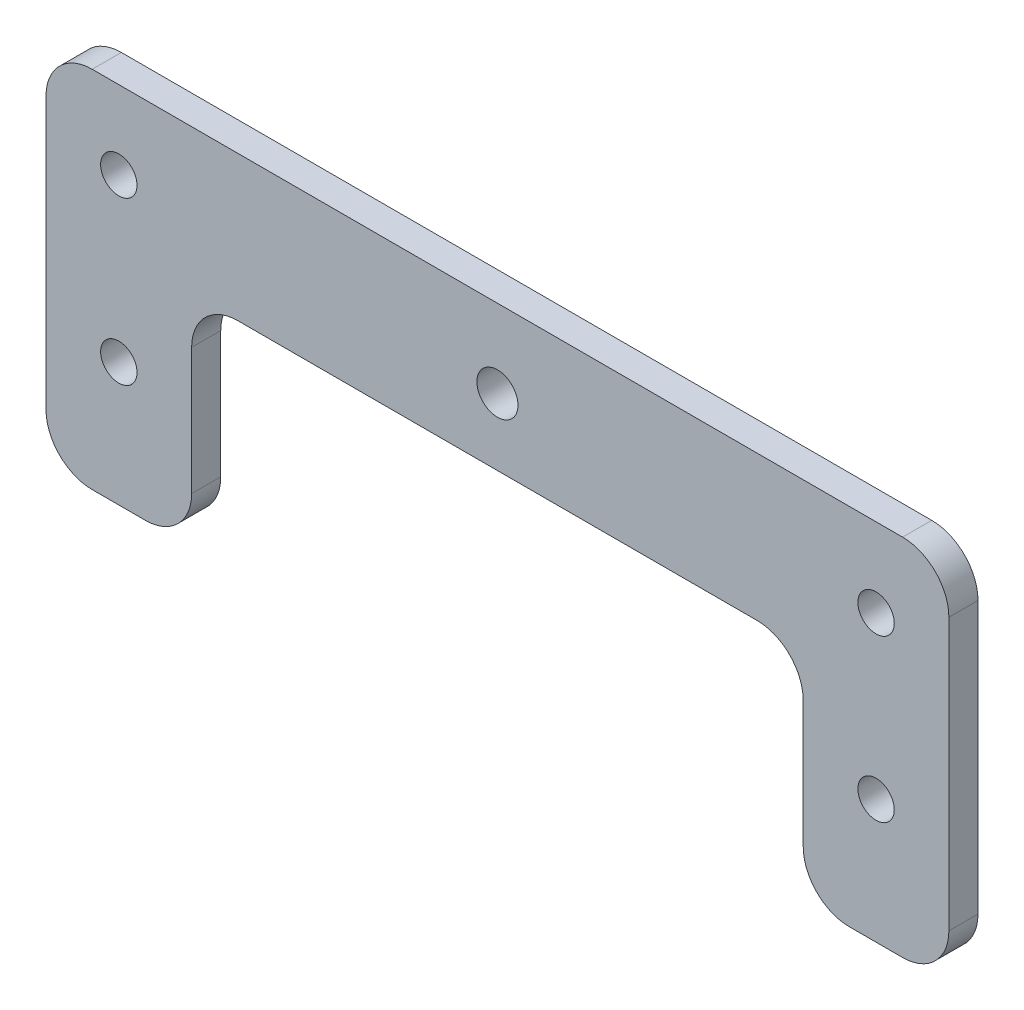
ISO-10303-21;
HEADER;
FILE_DESCRIPTION(('STEP AP214'),'2;1');
FILE_NAME('part.step','',(''),(''),'','','');
FILE_SCHEMA(('AUTOMOTIVE_DESIGN { 1 0 10303 214 1 1 1 1 }'));
ENDSEC;
DATA;
#1=APPLICATION_CONTEXT('core data for automotive mechanical design processes');
#2=APPLICATION_PROTOCOL_DEFINITION('international standard','automotive_design',2000,#1);
#3=PRODUCT_CONTEXT('',#1,'mechanical');
#4=PRODUCT('Part','Part','',(#3));
#5=PRODUCT_RELATED_PRODUCT_CATEGORY('part','',(#4));
#6=PRODUCT_DEFINITION_FORMATION('','',#4);
#7=PRODUCT_DEFINITION_CONTEXT('part definition',#1,'design');
#8=PRODUCT_DEFINITION('design','',#6,#7);
#9=PRODUCT_DEFINITION_SHAPE('','',#8);
#10=(LENGTH_UNIT() NAMED_UNIT(*) SI_UNIT(.MILLI.,.METRE.));
#11=(NAMED_UNIT(*) PLANE_ANGLE_UNIT() SI_UNIT($,.RADIAN.));
#12=(NAMED_UNIT(*) SI_UNIT($,.STERADIAN.) SOLID_ANGLE_UNIT());
#13=UNCERTAINTY_MEASURE_WITH_UNIT(LENGTH_MEASURE(1.E-05),#10,'distance_accuracy_value','');
#14=(GEOMETRIC_REPRESENTATION_CONTEXT(3) GLOBAL_UNCERTAINTY_ASSIGNED_CONTEXT((#13)) GLOBAL_UNIT_ASSIGNED_CONTEXT((#10,
#11,#12)) REPRESENTATION_CONTEXT('',''));
#15=CARTESIAN_POINT('',(0.,0.,0.));
#16=DIRECTION('',(0.,0.,1.));
#17=DIRECTION('',(1.,0.,0.));
#18=AXIS2_PLACEMENT_3D('',#15,#16,#17);
#19=CARTESIAN_POINT('',(0.,26.6043563241678,4.));
#20=DIRECTION('',(0.,1.,0.));
#21=DIRECTION('',(-1.,0.,0.));
#22=AXIS2_PLACEMENT_3D('',#19,#20,#21);
#23=PLANE('',#22);
#24=DIRECTION('',(1.,0.,0.));
#25=VECTOR('',#24,1.);
#26=CARTESIAN_POINT('',(0.,26.6043563241678,0.));
#27=LINE('',#26,#25);
#28=CARTESIAN_POINT('',(6.53805092256945,26.6043563241678,0.));
#29=VERTEX_POINT('',#28);
#30=CARTESIAN_POINT('',(117.838050922569,26.6043563241678,0.));
#31=VERTEX_POINT('',#30);
#32=EDGE_CURVE('E216',#29,#31,#27,.T.);
#33=ORIENTED_EDGE('',*,*,#32,.F.);
#34=DIRECTION('',(0.,0.,-1.));
#35=VECTOR('',#34,1.);
#36=CARTESIAN_POINT('',(6.53805092256945,26.6043563241678,4.));
#37=LINE('',#36,#35);
#38=CARTESIAN_POINT('',(6.53805092256945,26.6043563241678,4.));
#39=VERTEX_POINT('',#38);
#40=EDGE_CURVE('E11',#39,#29,#37,.T.);
#41=ORIENTED_EDGE('',*,*,#40,.F.);
#42=DIRECTION('',(1.,0.,0.));
#43=VECTOR('',#42,1.);
#44=CARTESIAN_POINT('',(0.,26.6043563241678,4.));
#45=LINE('',#44,#43);
#46=CARTESIAN_POINT('',(117.838050922569,26.6043563241678,4.));
#47=VERTEX_POINT('',#46);
#48=EDGE_CURVE('E351',#39,#47,#45,.T.);
#49=ORIENTED_EDGE('',*,*,#48,.T.);
#50=DIRECTION('',(0.,0.,-1.));
#51=VECTOR('',#50,1.);
#52=CARTESIAN_POINT('',(117.838050922569,26.6043563241678,4.));
#53=LINE('',#52,#51);
#54=EDGE_CURVE('E123',#47,#31,#53,.T.);
#55=ORIENTED_EDGE('',*,*,#54,.T.);
#56=EDGE_LOOP('',(#33,#41,#49,#55));
#57=FACE_BOUND('',#56,.T.);
#58=ADVANCED_FACE('F47',(#57),#23,.T.);
#59=CARTESIAN_POINT('',(6.53805092256941,20.2543563241678,4.));
#60=DIRECTION('',(0.,0.,-1.));
#61=DIRECTION('',(-1.,0.,0.));
#62=AXIS2_PLACEMENT_3D('',#59,#60,#61);
#63=CYLINDRICAL_SURFACE('',#62,6.35);
#64=CARTESIAN_POINT('',(6.53805092256941,20.2543563241678,0.));
#65=DIRECTION('',(0.,0.,1.));
#66=DIRECTION('',(1.,0.,0.));
#67=AXIS2_PLACEMENT_3D('',#64,#65,#66);
#68=CIRCLE('',#67,6.35);
#69=CARTESIAN_POINT('',(0.188050922569407,20.2543563241677,0.));
#70=VERTEX_POINT('',#69);
#71=EDGE_CURVE('E220',#29,#70,#68,.T.);
#72=ORIENTED_EDGE('',*,*,#71,.T.);
#73=DIRECTION('',(0.,0.,-1.));
#74=VECTOR('',#73,1.);
#75=CARTESIAN_POINT('',(0.188050922569407,20.2543563241677,4.));
#76=LINE('',#75,#74);
#77=CARTESIAN_POINT('',(0.188050922569407,20.2543563241677,4.));
#78=VERTEX_POINT('',#77);
#79=EDGE_CURVE('E57',#78,#70,#76,.T.);
#80=ORIENTED_EDGE('',*,*,#79,.F.);
#81=CARTESIAN_POINT('',(6.53805092256941,20.2543563241678,4.));
#82=DIRECTION('',(0.,0.,1.));
#83=DIRECTION('',(1.,0.,0.));
#84=AXIS2_PLACEMENT_3D('',#81,#82,#83);
#85=CIRCLE('',#84,6.35);
#86=EDGE_CURVE('E344',#39,#78,#85,.T.);
#87=ORIENTED_EDGE('',*,*,#86,.F.);
#88=ORIENTED_EDGE('',*,*,#40,.T.);
#89=EDGE_LOOP('',(#72,#80,#87,#88));
#90=FACE_BOUND('',#89,.T.);
#91=ADVANCED_FACE('F331',(#90),#63,.T.);
#92=CARTESIAN_POINT('',(0.188050922569409,0.,4.));
#93=DIRECTION('',(-1.,0.,0.));
#94=DIRECTION('',(0.,-1.,0.));
#95=AXIS2_PLACEMENT_3D('',#92,#93,#94);
#96=PLANE('',#95);
#97=DIRECTION('',(0.,1.,0.));
#98=VECTOR('',#97,1.);
#99=CARTESIAN_POINT('',(0.188050922569409,0.,0.));
#100=LINE('',#99,#98);
#101=CARTESIAN_POINT('',(0.188050922569411,-17.0456436758322,0.));
#102=VERTEX_POINT('',#101);
#103=EDGE_CURVE('E224',#102,#70,#100,.T.);
#104=ORIENTED_EDGE('',*,*,#103,.F.);
#105=DIRECTION('',(0.,0.,-1.));
#106=VECTOR('',#105,1.);
#107=CARTESIAN_POINT('',(0.188050922569411,-17.0456436758322,4.));
#108=LINE('',#107,#106);
#109=CARTESIAN_POINT('',(0.188050922569411,-17.0456436758322,4.));
#110=VERTEX_POINT('',#109);
#111=EDGE_CURVE('E319',#110,#102,#108,.T.);
#112=ORIENTED_EDGE('',*,*,#111,.F.);
#113=DIRECTION('',(0.,1.,0.));
#114=VECTOR('',#113,1.);
#115=CARTESIAN_POINT('',(0.188050922569409,0.,4.));
#116=LINE('',#115,#114);
#117=EDGE_CURVE('E328',#110,#78,#116,.T.);
#118=ORIENTED_EDGE('',*,*,#117,.T.);
#119=ORIENTED_EDGE('',*,*,#79,.T.);
#120=EDGE_LOOP('',(#104,#112,#118,#119));
#121=FACE_BOUND('',#120,.T.);
#122=ADVANCED_FACE('F326',(#121),#96,.T.);
#123=CARTESIAN_POINT('',(6.53805092256941,-17.0456436758322,4.));
#124=DIRECTION('',(0.,0.,-1.));
#125=DIRECTION('',(-1.,0.,0.));
#126=AXIS2_PLACEMENT_3D('',#123,#124,#125);
#127=CYLINDRICAL_SURFACE('',#126,6.35);
#128=CARTESIAN_POINT('',(6.53805092256941,-17.0456436758322,0.));
#129=DIRECTION('',(0.,0.,1.));
#130=DIRECTION('',(1.,0.,0.));
#131=AXIS2_PLACEMENT_3D('',#128,#129,#130);
#132=CIRCLE('',#131,6.35);
#133=CARTESIAN_POINT('',(6.53805092256945,-23.3956436758322,0.));
#134=VERTEX_POINT('',#133);
#135=EDGE_CURVE('E228',#134,#102,#132,.F.);
#136=ORIENTED_EDGE('',*,*,#135,.F.);
#137=DIRECTION('',(0.,0.,-1.));
#138=VECTOR('',#137,1.);
#139=CARTESIAN_POINT('',(6.53805092256945,-23.3956436758322,4.));
#140=LINE('',#139,#138);
#141=CARTESIAN_POINT('',(6.53805092256945,-23.3956436758322,4.));
#142=VERTEX_POINT('',#141);
#143=EDGE_CURVE('E316',#142,#134,#140,.T.);
#144=ORIENTED_EDGE('',*,*,#143,.F.);
#145=CARTESIAN_POINT('',(6.53805092256941,-17.0456436758322,4.));
#146=DIRECTION('',(0.,0.,1.));
#147=DIRECTION('',(1.,0.,0.));
#148=AXIS2_PLACEMENT_3D('',#145,#146,#147);
#149=CIRCLE('',#148,6.35);
#150=EDGE_CURVE('E342',#142,#110,#149,.F.);
#151=ORIENTED_EDGE('',*,*,#150,.T.);
#152=ORIENTED_EDGE('',*,*,#111,.T.);
#153=EDGE_LOOP('',(#136,#144,#151,#152));
#154=FACE_BOUND('',#153,.T.);
#155=ADVANCED_FACE('F338',(#154),#127,.T.);
#156=CARTESIAN_POINT('',(0.,-23.3956436758322,4.));
#157=DIRECTION('',(0.,1.,0.));
#158=DIRECTION('',(-1.,0.,0.));
#159=AXIS2_PLACEMENT_3D('',#156,#157,#158);
#160=PLANE('',#159);
#161=DIRECTION('',(1.,0.,0.));
#162=VECTOR('',#161,1.);
#163=CARTESIAN_POINT('',(0.,-23.3956436758322,0.));
#164=LINE('',#163,#162);
#165=CARTESIAN_POINT('',(13.8380509225694,-23.3956436758322,0.));
#166=VERTEX_POINT('',#165);
#167=EDGE_CURVE('E232',#134,#166,#164,.T.);
#168=ORIENTED_EDGE('',*,*,#167,.T.);
#169=DIRECTION('',(0.,0.,-1.));
#170=VECTOR('',#169,1.);
#171=CARTESIAN_POINT('',(13.8380509225694,-23.3956436758322,4.));
#172=LINE('',#171,#170);
#173=CARTESIAN_POINT('',(13.8380509225694,-23.3956436758322,4.));
#174=VERTEX_POINT('',#173);
#175=EDGE_CURVE('E312',#174,#166,#172,.T.);
#176=ORIENTED_EDGE('',*,*,#175,.F.);
#177=DIRECTION('',(1.,0.,0.));
#178=VECTOR('',#177,1.);
#179=CARTESIAN_POINT('',(0.,-23.3956436758322,4.));
#180=LINE('',#179,#178);
#181=EDGE_CURVE('E349',#142,#174,#180,.T.);
#182=ORIENTED_EDGE('',*,*,#181,.F.);
#183=ORIENTED_EDGE('',*,*,#143,.T.);
#184=EDGE_LOOP('',(#168,#176,#182,#183));
#185=FACE_BOUND('',#184,.T.);
#186=ADVANCED_FACE('F486',(#185),#160,.F.);
#187=CARTESIAN_POINT('',(13.8380509225694,-17.0456436758322,4.));
#188=DIRECTION('',(0.,0.,-1.));
#189=DIRECTION('',(-1.,0.,0.));
#190=AXIS2_PLACEMENT_3D('',#187,#188,#189);
#191=CYLINDRICAL_SURFACE('',#190,6.35);
#192=CARTESIAN_POINT('',(13.8380509225694,-17.0456436758322,0.));
#193=DIRECTION('',(0.,0.,1.));
#194=DIRECTION('',(1.,0.,0.));
#195=AXIS2_PLACEMENT_3D('',#192,#193,#194);
#196=CIRCLE('',#195,6.35);
#197=CARTESIAN_POINT('',(20.1880509225694,-17.0456436758322,0.));
#198=VERTEX_POINT('',#197);
#199=EDGE_CURVE('E236',#166,#198,#196,.T.);
#200=ORIENTED_EDGE('',*,*,#199,.T.);
#201=DIRECTION('',(0.,0.,-1.));
#202=VECTOR('',#201,1.);
#203=CARTESIAN_POINT('',(20.1880509225694,-17.0456436758322,4.));
#204=LINE('',#203,#202);
#205=CARTESIAN_POINT('',(20.1880509225694,-17.0456436758322,4.));
#206=VERTEX_POINT('',#205);
#207=EDGE_CURVE('E309',#206,#198,#204,.T.);
#208=ORIENTED_EDGE('',*,*,#207,.F.);
#209=CARTESIAN_POINT('',(13.8380509225694,-17.0456436758322,4.));
#210=DIRECTION('',(0.,0.,1.));
#211=DIRECTION('',(1.,0.,0.));
#212=AXIS2_PLACEMENT_3D('',#209,#210,#211);
#213=CIRCLE('',#212,6.35);
#214=EDGE_CURVE('E357',#174,#206,#213,.T.);
#215=ORIENTED_EDGE('',*,*,#214,.F.);
#216=ORIENTED_EDGE('',*,*,#175,.T.);
#217=EDGE_LOOP('',(#200,#208,#215,#216));
#218=FACE_BOUND('',#217,.T.);
#219=ADVANCED_FACE('F482',(#218),#191,.T.);
#220=CARTESIAN_POINT('',(20.1880509225694,0.,4.));
#221=DIRECTION('',(1.,0.,0.));
#222=DIRECTION('',(0.,1.,0.));
#223=AXIS2_PLACEMENT_3D('',#220,#221,#222);
#224=PLANE('',#223);
#225=DIRECTION('',(0.,-1.,0.));
#226=VECTOR('',#225,1.);
#227=CARTESIAN_POINT('',(20.1880509225694,0.,0.));
#228=LINE('',#227,#226);
#229=CARTESIAN_POINT('',(20.1880509225694,0.349416953919576,0.));
#230=VERTEX_POINT('',#229);
#231=EDGE_CURVE('E240',#230,#198,#228,.T.);
#232=ORIENTED_EDGE('',*,*,#231,.F.);
#233=DIRECTION('',(0.,0.,-1.));
#234=VECTOR('',#233,1.);
#235=CARTESIAN_POINT('',(20.1880509225694,0.349416953919576,4.));
#236=LINE('',#235,#234);
#237=CARTESIAN_POINT('',(20.1880509225694,0.349416953919576,4.));
#238=VERTEX_POINT('',#237);
#239=EDGE_CURVE('E306',#238,#230,#236,.T.);
#240=ORIENTED_EDGE('',*,*,#239,.F.);
#241=DIRECTION('',(0.,-1.,0.));
#242=VECTOR('',#241,1.);
#243=CARTESIAN_POINT('',(20.1880509225694,0.,4.));
#244=LINE('',#243,#242);
#245=EDGE_CURVE('E360',#238,#206,#244,.T.);
#246=ORIENTED_EDGE('',*,*,#245,.T.);
#247=ORIENTED_EDGE('',*,*,#207,.T.);
#248=EDGE_LOOP('',(#232,#240,#246,#247));
#249=FACE_BOUND('',#248,.T.);
#250=ADVANCED_FACE('F478',(#249),#224,.T.);
#251=CARTESIAN_POINT('',(26.5380509225694,0.349416953919623,4.));
#252=DIRECTION('',(0.,0.,-1.));
#253=DIRECTION('',(-1.,0.,0.));
#254=AXIS2_PLACEMENT_3D('',#251,#252,#253);
#255=CYLINDRICAL_SURFACE('',#254,6.35);
#256=CARTESIAN_POINT('',(26.5380509225694,0.349416953919623,0.));
#257=DIRECTION('',(0.,0.,1.));
#258=DIRECTION('',(1.,0.,0.));
#259=AXIS2_PLACEMENT_3D('',#256,#257,#258);
#260=CIRCLE('',#259,6.35);
#261=CARTESIAN_POINT('',(26.5380509225695,6.69941695391962,0.));
#262=VERTEX_POINT('',#261);
#263=EDGE_CURVE('E244',#262,#230,#260,.T.);
#264=ORIENTED_EDGE('',*,*,#263,.F.);
#265=DIRECTION('',(0.,0.,-1.));
#266=VECTOR('',#265,1.);
#267=CARTESIAN_POINT('',(26.5380509225695,6.69941695391962,4.));
#268=LINE('',#267,#266);
#269=CARTESIAN_POINT('',(26.5380509225695,6.69941695391962,4.));
#270=VERTEX_POINT('',#269);
#271=EDGE_CURVE('E303',#270,#262,#268,.T.);
#272=ORIENTED_EDGE('',*,*,#271,.F.);
#273=CARTESIAN_POINT('',(26.5380509225694,0.349416953919623,4.));
#274=DIRECTION('',(0.,0.,1.));
#275=DIRECTION('',(1.,0.,0.));
#276=AXIS2_PLACEMENT_3D('',#273,#274,#275);
#277=CIRCLE('',#276,6.35);
#278=EDGE_CURVE('E364',#270,#238,#277,.T.);
#279=ORIENTED_EDGE('',*,*,#278,.T.);
#280=ORIENTED_EDGE('',*,*,#239,.T.);
#281=EDGE_LOOP('',(#264,#272,#279,#280));
#282=FACE_BOUND('',#281,.T.);
#283=ADVANCED_FACE('F474',(#282),#255,.F.);
#284=CARTESIAN_POINT('',(0.,6.69941695391962,4.));
#285=DIRECTION('',(0.,1.,0.));
#286=DIRECTION('',(-1.,0.,0.));
#287=AXIS2_PLACEMENT_3D('',#284,#285,#286);
#288=PLANE('',#287);
#289=DIRECTION('',(1.,0.,0.));
#290=VECTOR('',#289,1.);
#291=CARTESIAN_POINT('',(0.,6.69941695391962,0.));
#292=LINE('',#291,#290);
#293=CARTESIAN_POINT('',(97.8380509225694,6.69941695391962,0.));
#294=VERTEX_POINT('',#293);
#295=EDGE_CURVE('E248',#262,#294,#292,.T.);
#296=ORIENTED_EDGE('',*,*,#295,.T.);
#297=DIRECTION('',(0.,0.,-1.));
#298=VECTOR('',#297,1.);
#299=CARTESIAN_POINT('',(97.8380509225694,6.69941695391962,4.));
#300=LINE('',#299,#298);
#301=CARTESIAN_POINT('',(97.8380509225694,6.69941695391962,4.));
#302=VERTEX_POINT('',#301);
#303=EDGE_CURVE('E300',#302,#294,#300,.T.);
#304=ORIENTED_EDGE('',*,*,#303,.F.);
#305=DIRECTION('',(1.,0.,0.));
#306=VECTOR('',#305,1.);
#307=CARTESIAN_POINT('',(0.,6.69941695391962,4.));
#308=LINE('',#307,#306);
#309=EDGE_CURVE('E368',#270,#302,#308,.T.);
#310=ORIENTED_EDGE('',*,*,#309,.F.);
#311=ORIENTED_EDGE('',*,*,#271,.T.);
#312=EDGE_LOOP('',(#296,#304,#310,#311));
#313=FACE_BOUND('',#312,.T.);
#314=ADVANCED_FACE('F470',(#313),#288,.F.);
#315=CARTESIAN_POINT('',(97.8380509225694,0.349416953919623,4.));
#316=DIRECTION('',(0.,0.,-1.));
#317=DIRECTION('',(-1.,0.,0.));
#318=AXIS2_PLACEMENT_3D('',#315,#316,#317);
#319=CYLINDRICAL_SURFACE('',#318,6.35);
#320=CARTESIAN_POINT('',(97.8380509225694,0.349416953919623,0.));
#321=DIRECTION('',(0.,0.,1.));
#322=DIRECTION('',(1.,0.,0.));
#323=AXIS2_PLACEMENT_3D('',#320,#321,#322);
#324=CIRCLE('',#323,6.35);
#325=CARTESIAN_POINT('',(104.188050922569,0.349416953919632,0.));
#326=VERTEX_POINT('',#325);
#327=EDGE_CURVE('E252',#326,#294,#324,.T.);
#328=ORIENTED_EDGE('',*,*,#327,.F.);
#329=DIRECTION('',(0.,0.,-1.));
#330=VECTOR('',#329,1.);
#331=CARTESIAN_POINT('',(104.188050922569,0.349416953919632,4.));
#332=LINE('',#331,#330);
#333=CARTESIAN_POINT('',(104.188050922569,0.349416953919632,4.));
#334=VERTEX_POINT('',#333);
#335=EDGE_CURVE('E297',#334,#326,#332,.T.);
#336=ORIENTED_EDGE('',*,*,#335,.F.);
#337=CARTESIAN_POINT('',(97.8380509225694,0.349416953919623,4.));
#338=DIRECTION('',(0.,0.,1.));
#339=DIRECTION('',(1.,0.,0.));
#340=AXIS2_PLACEMENT_3D('',#337,#338,#339);
#341=CIRCLE('',#340,6.35);
#342=EDGE_CURVE('E371',#334,#302,#341,.T.);
#343=ORIENTED_EDGE('',*,*,#342,.T.);
#344=ORIENTED_EDGE('',*,*,#303,.T.);
#345=EDGE_LOOP('',(#328,#336,#343,#344));
#346=FACE_BOUND('',#345,.T.);
#347=ADVANCED_FACE('F466',(#346),#319,.F.);
#348=CARTESIAN_POINT('',(104.188050922569,0.,4.));
#349=DIRECTION('',(1.,0.,0.));
#350=DIRECTION('',(0.,1.,0.));
#351=AXIS2_PLACEMENT_3D('',#348,#349,#350);
#352=PLANE('',#351);
#353=DIRECTION('',(0.,-1.,0.));
#354=VECTOR('',#353,1.);
#355=CARTESIAN_POINT('',(104.188050922569,0.,0.));
#356=LINE('',#355,#354);
#357=CARTESIAN_POINT('',(104.188050922569,-17.0456436758322,0.));
#358=VERTEX_POINT('',#357);
#359=EDGE_CURVE('E256',#326,#358,#356,.T.);
#360=ORIENTED_EDGE('',*,*,#359,.T.);
#361=DIRECTION('',(0.,0.,-1.));
#362=VECTOR('',#361,1.);
#363=CARTESIAN_POINT('',(104.188050922569,-17.0456436758322,4.));
#364=LINE('',#363,#362);
#365=CARTESIAN_POINT('',(104.188050922569,-17.0456436758322,4.));
#366=VERTEX_POINT('',#365);
#367=EDGE_CURVE('E294',#366,#358,#364,.T.);
#368=ORIENTED_EDGE('',*,*,#367,.F.);
#369=DIRECTION('',(0.,-1.,0.));
#370=VECTOR('',#369,1.);
#371=CARTESIAN_POINT('',(104.188050922569,0.,4.));
#372=LINE('',#371,#370);
#373=EDGE_CURVE('E375',#334,#366,#372,.T.);
#374=ORIENTED_EDGE('',*,*,#373,.F.);
#375=ORIENTED_EDGE('',*,*,#335,.T.);
#376=EDGE_LOOP('',(#360,#368,#374,#375));
#377=FACE_BOUND('',#376,.T.);
#378=ADVANCED_FACE('F462',(#377),#352,.F.);
#379=CARTESIAN_POINT('',(110.538050922569,-17.0456436758322,4.));
#380=DIRECTION('',(0.,0.,-1.));
#381=DIRECTION('',(-1.,0.,0.));
#382=AXIS2_PLACEMENT_3D('',#379,#380,#381);
#383=CYLINDRICAL_SURFACE('',#382,6.35);
#384=CARTESIAN_POINT('',(110.538050922569,-17.0456436758322,0.));
#385=DIRECTION('',(0.,0.,1.));
#386=DIRECTION('',(1.,0.,0.));
#387=AXIS2_PLACEMENT_3D('',#384,#385,#386);
#388=CIRCLE('',#387,6.35);
#389=CARTESIAN_POINT('',(110.538050922569,-23.3956436758322,0.));
#390=VERTEX_POINT('',#389);
#391=EDGE_CURVE('E260',#390,#358,#388,.F.);
#392=ORIENTED_EDGE('',*,*,#391,.F.);
#393=DIRECTION('',(0.,0.,-1.));
#394=VECTOR('',#393,1.);
#395=CARTESIAN_POINT('',(110.538050922569,-23.3956436758322,4.));
#396=LINE('',#395,#394);
#397=CARTESIAN_POINT('',(110.538050922569,-23.3956436758322,4.));
#398=VERTEX_POINT('',#397);
#399=EDGE_CURVE('E291',#398,#390,#396,.T.);
#400=ORIENTED_EDGE('',*,*,#399,.F.);
#401=CARTESIAN_POINT('',(110.538050922569,-17.0456436758322,4.));
#402=DIRECTION('',(0.,0.,1.));
#403=DIRECTION('',(1.,0.,0.));
#404=AXIS2_PLACEMENT_3D('',#401,#402,#403);
#405=CIRCLE('',#404,6.35);
#406=EDGE_CURVE('E378',#398,#366,#405,.F.);
#407=ORIENTED_EDGE('',*,*,#406,.T.);
#408=ORIENTED_EDGE('',*,*,#367,.T.);
#409=EDGE_LOOP('',(#392,#400,#407,#408));
#410=FACE_BOUND('',#409,.T.);
#411=ADVANCED_FACE('F459',(#410),#383,.T.);
#412=CARTESIAN_POINT('',(0.,-23.3956436758323,4.));
#413=DIRECTION('',(0.,-1.,0.));
#414=DIRECTION('',(1.,0.,0.));
#415=AXIS2_PLACEMENT_3D('',#412,#413,#414);
#416=PLANE('',#415);
#417=DIRECTION('',(-1.,0.,0.));
#418=VECTOR('',#417,1.);
#419=CARTESIAN_POINT('',(0.,-23.3956436758323,0.));
#420=LINE('',#419,#418);
#421=CARTESIAN_POINT('',(117.838050922569,-23.3956436758322,0.));
#422=VERTEX_POINT('',#421);
#423=EDGE_CURVE('E264',#422,#390,#420,.T.);
#424=ORIENTED_EDGE('',*,*,#423,.F.);
#425=DIRECTION('',(0.,0.,-1.));
#426=VECTOR('',#425,1.);
#427=CARTESIAN_POINT('',(117.838050922569,-23.3956436758322,4.));
#428=LINE('',#427,#426);
#429=CARTESIAN_POINT('',(117.838050922569,-23.3956436758322,4.));
#430=VERTEX_POINT('',#429);
#431=EDGE_CURVE('E187',#430,#422,#428,.T.);
#432=ORIENTED_EDGE('',*,*,#431,.F.);
#433=DIRECTION('',(-1.,0.,0.));
#434=VECTOR('',#433,1.);
#435=CARTESIAN_POINT('',(0.,-23.3956436758323,4.));
#436=LINE('',#435,#434);
#437=EDGE_CURVE('E174',#430,#398,#436,.T.);
#438=ORIENTED_EDGE('',*,*,#437,.T.);
#439=ORIENTED_EDGE('',*,*,#399,.T.);
#440=EDGE_LOOP('',(#424,#432,#438,#439));
#441=FACE_BOUND('',#440,.T.);
#442=ADVANCED_FACE('F384',(#441),#416,.T.);
#443=CARTESIAN_POINT('',(117.838050922569,-17.0456436758322,4.));
#444=DIRECTION('',(0.,0.,-1.));
#445=DIRECTION('',(-1.,0.,0.));
#446=AXIS2_PLACEMENT_3D('',#443,#444,#445);
#447=CYLINDRICAL_SURFACE('',#446,6.35);
#448=CARTESIAN_POINT('',(117.838050922569,-17.0456436758322,0.));
#449=DIRECTION('',(0.,0.,1.));
#450=DIRECTION('',(1.,0.,0.));
#451=AXIS2_PLACEMENT_3D('',#448,#449,#450);
#452=CIRCLE('',#451,6.35);
#453=CARTESIAN_POINT('',(124.188050922569,-17.0456436758322,0.));
#454=VERTEX_POINT('',#453);
#455=EDGE_CURVE('E182',#422,#454,#452,.T.);
#456=ORIENTED_EDGE('',*,*,#455,.T.);
#457=DIRECTION('',(0.,0.,-1.));
#458=VECTOR('',#457,1.);
#459=CARTESIAN_POINT('',(124.188050922569,-17.0456436758322,4.));
#460=LINE('',#459,#458);
#461=CARTESIAN_POINT('',(124.188050922569,-17.0456436758322,4.));
#462=VERTEX_POINT('',#461);
#463=EDGE_CURVE('E179',#462,#454,#460,.T.);
#464=ORIENTED_EDGE('',*,*,#463,.F.);
#465=CARTESIAN_POINT('',(117.838050922569,-17.0456436758322,4.));
#466=DIRECTION('',(0.,0.,1.));
#467=DIRECTION('',(1.,0.,0.));
#468=AXIS2_PLACEMENT_3D('',#465,#466,#467);
#469=CIRCLE('',#468,6.35);
#470=EDGE_CURVE('E166',#430,#462,#469,.T.);
#471=ORIENTED_EDGE('',*,*,#470,.F.);
#472=ORIENTED_EDGE('',*,*,#431,.T.);
#473=EDGE_LOOP('',(#456,#464,#471,#472));
#474=FACE_BOUND('',#473,.T.);
#475=ADVANCED_FACE('F180',(#474),#447,.T.);
#476=CARTESIAN_POINT('',(124.188050922569,0.,4.));
#477=DIRECTION('',(1.,0.,0.));
#478=DIRECTION('',(0.,0.,-1.));
#479=AXIS2_PLACEMENT_3D('',#476,#477,#478);
#480=PLANE('',#479);
#481=DIRECTION('',(0.,-1.,0.));
#482=VECTOR('',#481,1.);
#483=CARTESIAN_POINT('',(124.188050922569,0.,0.));
#484=LINE('',#483,#482);
#485=CARTESIAN_POINT('',(124.188050922569,20.2543563241678,0.));
#486=VERTEX_POINT('',#485);
#487=EDGE_CURVE('E270',#486,#454,#484,.T.);
#488=ORIENTED_EDGE('',*,*,#487,.F.);
#489=DIRECTION('',(0.,0.,-1.));
#490=VECTOR('',#489,1.);
#491=CARTESIAN_POINT('',(124.188050922569,20.2543563241678,4.));
#492=LINE('',#491,#490);
#493=CARTESIAN_POINT('',(124.188050922569,20.2543563241678,4.));
#494=VERTEX_POINT('',#493);
#495=EDGE_CURVE('E116',#494,#486,#492,.T.);
#496=ORIENTED_EDGE('',*,*,#495,.F.);
#497=DIRECTION('',(0.,-1.,0.));
#498=VECTOR('',#497,1.);
#499=CARTESIAN_POINT('',(124.188050922569,0.,4.));
#500=LINE('',#499,#498);
#501=EDGE_CURVE('E171',#494,#462,#500,.T.);
#502=ORIENTED_EDGE('',*,*,#501,.T.);
#503=ORIENTED_EDGE('',*,*,#463,.T.);
#504=EDGE_LOOP('',(#488,#496,#502,#503));
#505=FACE_BOUND('',#504,.T.);
#506=ADVANCED_FACE('F189',(#505),#480,.T.);
#507=CARTESIAN_POINT('',(10.1880509225694,15.8664983327679,4.));
#508=DIRECTION('',(0.,0.,-1.));
#509=DIRECTION('',(-1.,0.,0.));
#510=AXIS2_PLACEMENT_3D('',#507,#508,#509);
#511=CYLINDRICAL_SURFACE('',#510,2.5);
#512=CARTESIAN_POINT('',(10.1880509225694,15.8664983327679,4.));
#513=DIRECTION('',(0.,0.,1.));
#514=DIRECTION('',(1.,0.,0.));
#515=AXIS2_PLACEMENT_3D('',#512,#513,#514);
#516=CIRCLE('',#515,2.5);
#517=CARTESIAN_POINT('',(12.6880509225694,15.8664983327679,4.));
#518=VERTEX_POINT('',#517);
#519=EDGE_CURVE('E193',#518,#518,#516,.T.);
#520=ORIENTED_EDGE('',*,*,#519,.T.);
#521=EDGE_LOOP('',(#520));
#522=FACE_BOUND('',#521,.T.);
#523=CARTESIAN_POINT('',(10.1880509225694,15.8664983327679,0.));
#524=DIRECTION('',(0.,0.,1.));
#525=DIRECTION('',(1.,0.,0.));
#526=AXIS2_PLACEMENT_3D('',#523,#524,#525);
#527=CIRCLE('',#526,2.5);
#528=CARTESIAN_POINT('',(12.6880509225694,15.8664983327679,0.));
#529=VERTEX_POINT('',#528);
#530=EDGE_CURVE('E276',#529,#529,#527,.T.);
#531=ORIENTED_EDGE('',*,*,#530,.F.);
#532=EDGE_LOOP('',(#531));
#533=FACE_BOUND('',#532,.T.);
#534=ADVANCED_FACE('F447',(#522,#533),#511,.F.);
#535=CARTESIAN_POINT('',(117.838050922569,20.2543563241678,4.));
#536=DIRECTION('',(0.,0.,-1.));
#537=DIRECTION('',(-1.,0.,0.));
#538=AXIS2_PLACEMENT_3D('',#535,#536,#537);
#539=CYLINDRICAL_SURFACE('',#538,6.35);
#540=CARTESIAN_POINT('',(117.838050922569,20.2543563241678,0.));
#541=DIRECTION('',(0.,0.,1.));
#542=DIRECTION('',(1.,0.,0.));
#543=AXIS2_PLACEMENT_3D('',#540,#541,#542);
#544=CIRCLE('',#543,6.35);
#545=EDGE_CURVE('E273',#486,#31,#544,.T.);
#546=ORIENTED_EDGE('',*,*,#545,.T.);
#547=ORIENTED_EDGE('',*,*,#54,.F.);
#548=CARTESIAN_POINT('',(117.838050922569,20.2543563241678,4.));
#549=DIRECTION('',(0.,0.,1.));
#550=DIRECTION('',(1.,0.,0.));
#551=AXIS2_PLACEMENT_3D('',#548,#549,#550);
#552=CIRCLE('',#551,6.35);
#553=EDGE_CURVE('E65',#494,#47,#552,.T.);
#554=ORIENTED_EDGE('',*,*,#553,.F.);
#555=ORIENTED_EDGE('',*,*,#495,.T.);
#556=EDGE_LOOP('',(#546,#547,#554,#555));
#557=FACE_BOUND('',#556,.T.);
#558=ADVANCED_FACE('F386',(#557),#539,.T.);
#559=CARTESIAN_POINT('',(114.188050922569,15.771437703016,4.));
#560=DIRECTION('',(0.,0.,-1.));
#561=DIRECTION('',(-1.,0.,0.));
#562=AXIS2_PLACEMENT_3D('',#559,#560,#561);
#563=CYLINDRICAL_SURFACE('',#562,2.5);
#564=CARTESIAN_POINT('',(114.188050922569,15.771437703016,4.));
#565=DIRECTION('',(0.,0.,1.));
#566=DIRECTION('',(1.,0.,0.));
#567=AXIS2_PLACEMENT_3D('',#564,#565,#566);
#568=CIRCLE('',#567,2.5);
#569=CARTESIAN_POINT('',(116.688050922569,15.771437703016,4.));
#570=VERTEX_POINT('',#569);
#571=EDGE_CURVE('E388',#570,#570,#568,.T.);
#572=ORIENTED_EDGE('',*,*,#571,.T.);
#573=EDGE_LOOP('',(#572));
#574=FACE_BOUND('',#573,.T.);
#575=CARTESIAN_POINT('',(114.188050922569,15.771437703016,0.));
#576=DIRECTION('',(0.,0.,1.));
#577=DIRECTION('',(1.,0.,0.));
#578=AXIS2_PLACEMENT_3D('',#575,#576,#577);
#579=CIRCLE('',#578,2.5);
#580=CARTESIAN_POINT('',(116.688050922569,15.771437703016,0.));
#581=VERTEX_POINT('',#580);
#582=EDGE_CURVE('E212',#581,#581,#579,.T.);
#583=ORIENTED_EDGE('',*,*,#582,.F.);
#584=EDGE_LOOP('',(#583));
#585=FACE_BOUND('',#584,.T.);
#586=ADVANCED_FACE('F411',(#574,#585),#563,.F.);
#587=CARTESIAN_POINT('',(114.188050922569,-6.39564367583222,4.));
#588=DIRECTION('',(0.,0.,-1.));
#589=DIRECTION('',(-1.,0.,0.));
#590=AXIS2_PLACEMENT_3D('',#587,#588,#589);
#591=CYLINDRICAL_SURFACE('',#590,2.5);
#592=CARTESIAN_POINT('',(114.188050922569,-6.39564367583222,4.));
#593=DIRECTION('',(0.,0.,1.));
#594=DIRECTION('',(1.,0.,0.));
#595=AXIS2_PLACEMENT_3D('',#592,#593,#594);
#596=CIRCLE('',#595,2.5);
#597=CARTESIAN_POINT('',(116.688050922569,-6.39564367583222,4.));
#598=VERTEX_POINT('',#597);
#599=EDGE_CURVE('E391',#598,#598,#596,.F.);
#600=ORIENTED_EDGE('',*,*,#599,.F.);
#601=EDGE_LOOP('',(#600));
#602=FACE_BOUND('',#601,.T.);
#603=CARTESIAN_POINT('',(114.188050922569,-6.39564367583222,0.));
#604=DIRECTION('',(0.,0.,1.));
#605=DIRECTION('',(1.,0.,0.));
#606=AXIS2_PLACEMENT_3D('',#603,#604,#605);
#607=CIRCLE('',#606,2.5);
#608=CARTESIAN_POINT('',(116.688050922569,-6.39564367583222,0.));
#609=VERTEX_POINT('',#608);
#610=EDGE_CURVE('E208',#609,#609,#607,.F.);
#611=ORIENTED_EDGE('',*,*,#610,.T.);
#612=EDGE_LOOP('',(#611));
#613=FACE_BOUND('',#612,.T.);
#614=ADVANCED_FACE('F414',(#602,#613),#591,.F.);
#615=CARTESIAN_POINT('',(62.1880509225694,15.8664983327679,4.));
#616=DIRECTION('',(0.,0.,-1.));
#617=DIRECTION('',(-1.,0.,0.));
#618=AXIS2_PLACEMENT_3D('',#615,#616,#617);
#619=CYLINDRICAL_SURFACE('',#618,2.8213685039973);
#620=CARTESIAN_POINT('',(62.1880509225694,15.8664983327679,4.));
#621=DIRECTION('',(0.,0.,1.));
#622=DIRECTION('',(1.,0.,0.));
#623=AXIS2_PLACEMENT_3D('',#620,#621,#622);
#624=CIRCLE('',#623,2.8213685039973);
#625=CARTESIAN_POINT('',(65.0094194265667,15.8664983327679,4.));
#626=VERTEX_POINT('',#625);
#627=EDGE_CURVE('E284',#626,#626,#624,.T.);
#628=ORIENTED_EDGE('',*,*,#627,.T.);
#629=EDGE_LOOP('',(#628));
#630=FACE_BOUND('',#629,.T.);
#631=CARTESIAN_POINT('',(62.1880509225694,15.8664983327679,0.));
#632=DIRECTION('',(0.,0.,1.));
#633=DIRECTION('',(1.,0.,0.));
#634=AXIS2_PLACEMENT_3D('',#631,#632,#633);
#635=CIRCLE('',#634,2.8213685039973);
#636=CARTESIAN_POINT('',(65.0094194265667,15.8664983327679,0.));
#637=VERTEX_POINT('',#636);
#638=EDGE_CURVE('E204',#637,#637,#635,.T.);
#639=ORIENTED_EDGE('',*,*,#638,.F.);
#640=EDGE_LOOP('',(#639));
#641=FACE_BOUND('',#640,.T.);
#642=ADVANCED_FACE('F49',(#630,#641),#619,.F.);
#643=CARTESIAN_POINT('',(10.1880509225694,-6.39564367583224,4.));
#644=DIRECTION('',(0.,0.,-1.));
#645=DIRECTION('',(-1.,0.,0.));
#646=AXIS2_PLACEMENT_3D('',#643,#644,#645);
#647=CYLINDRICAL_SURFACE('',#646,2.5);
#648=CARTESIAN_POINT('',(10.1880509225694,-6.39564367583224,4.));
#649=DIRECTION('',(0.,0.,1.));
#650=DIRECTION('',(1.,0.,0.));
#651=AXIS2_PLACEMENT_3D('',#648,#649,#650);
#652=CIRCLE('',#651,2.5);
#653=CARTESIAN_POINT('',(12.6880509225694,-6.39564367583224,4.));
#654=VERTEX_POINT('',#653);
#655=EDGE_CURVE('E200',#654,#654,#652,.T.);
#656=ORIENTED_EDGE('',*,*,#655,.T.);
#657=EDGE_LOOP('',(#656));
#658=FACE_BOUND('',#657,.T.);
#659=CARTESIAN_POINT('',(10.1880509225694,-6.39564367583224,0.));
#660=DIRECTION('',(0.,0.,1.));
#661=DIRECTION('',(1.,0.,0.));
#662=AXIS2_PLACEMENT_3D('',#659,#660,#661);
#663=CIRCLE('',#662,2.5);
#664=CARTESIAN_POINT('',(12.6880509225694,-6.39564367583224,0.));
#665=VERTEX_POINT('',#664);
#666=EDGE_CURVE('E280',#665,#665,#663,.T.);
#667=ORIENTED_EDGE('',*,*,#666,.F.);
#668=EDGE_LOOP('',(#667));
#669=FACE_BOUND('',#668,.T.);
#670=ADVANCED_FACE('F405',(#658,#669),#647,.F.);
#671=CARTESIAN_POINT('',(0.,0.,4.));
#672=DIRECTION('',(0.,0.,1.));
#673=DIRECTION('',(1.,0.,0.));
#674=AXIS2_PLACEMENT_3D('',#671,#672,#673);
#675=PLANE('',#674);
#676=ORIENTED_EDGE('',*,*,#627,.F.);
#677=EDGE_LOOP('',(#676));
#678=FACE_BOUND('',#677,.T.);
#679=ORIENTED_EDGE('',*,*,#599,.T.);
#680=EDGE_LOOP('',(#679));
#681=FACE_BOUND('',#680,.T.);
#682=ORIENTED_EDGE('',*,*,#571,.F.);
#683=EDGE_LOOP('',(#682));
#684=FACE_BOUND('',#683,.T.);
#685=ORIENTED_EDGE('',*,*,#48,.F.);
#686=ORIENTED_EDGE('',*,*,#86,.T.);
#687=ORIENTED_EDGE('',*,*,#117,.F.);
#688=ORIENTED_EDGE('',*,*,#150,.F.);
#689=ORIENTED_EDGE('',*,*,#181,.T.);
#690=ORIENTED_EDGE('',*,*,#214,.T.);
#691=ORIENTED_EDGE('',*,*,#245,.F.);
#692=ORIENTED_EDGE('',*,*,#278,.F.);
#693=ORIENTED_EDGE('',*,*,#309,.T.);
#694=ORIENTED_EDGE('',*,*,#342,.F.);
#695=ORIENTED_EDGE('',*,*,#373,.T.);
#696=ORIENTED_EDGE('',*,*,#406,.F.);
#697=ORIENTED_EDGE('',*,*,#437,.F.);
#698=ORIENTED_EDGE('',*,*,#470,.T.);
#699=ORIENTED_EDGE('',*,*,#501,.F.);
#700=ORIENTED_EDGE('',*,*,#553,.T.);
#701=EDGE_LOOP('',(#685,#686,#687,#688,#689,#690,#691,#692,#693,#694,#695,#696,#697,#698,#699,#700));
#702=FACE_BOUND('',#701,.T.);
#703=ORIENTED_EDGE('',*,*,#519,.F.);
#704=EDGE_LOOP('',(#703));
#705=FACE_BOUND('',#704,.T.);
#706=ORIENTED_EDGE('',*,*,#655,.F.);
#707=EDGE_LOOP('',(#706));
#708=FACE_BOUND('',#707,.T.);
#709=ADVANCED_FACE('F168',(#678,#681,#684,#702,#705,#708),#675,.T.);
#710=CARTESIAN_POINT('',(0.,0.,0.));
#711=DIRECTION('',(0.,0.,1.));
#712=DIRECTION('',(1.,0.,0.));
#713=AXIS2_PLACEMENT_3D('',#710,#711,#712);
#714=PLANE('',#713);
#715=ORIENTED_EDGE('',*,*,#638,.T.);
#716=EDGE_LOOP('',(#715));
#717=FACE_BOUND('',#716,.T.);
#718=ORIENTED_EDGE('',*,*,#610,.F.);
#719=EDGE_LOOP('',(#718));
#720=FACE_BOUND('',#719,.T.);
#721=ORIENTED_EDGE('',*,*,#582,.T.);
#722=EDGE_LOOP('',(#721));
#723=FACE_BOUND('',#722,.T.);
#724=ORIENTED_EDGE('',*,*,#32,.T.);
#725=ORIENTED_EDGE('',*,*,#545,.F.);
#726=ORIENTED_EDGE('',*,*,#487,.T.);
#727=ORIENTED_EDGE('',*,*,#455,.F.);
#728=ORIENTED_EDGE('',*,*,#423,.T.);
#729=ORIENTED_EDGE('',*,*,#391,.T.);
#730=ORIENTED_EDGE('',*,*,#359,.F.);
#731=ORIENTED_EDGE('',*,*,#327,.T.);
#732=ORIENTED_EDGE('',*,*,#295,.F.);
#733=ORIENTED_EDGE('',*,*,#263,.T.);
#734=ORIENTED_EDGE('',*,*,#231,.T.);
#735=ORIENTED_EDGE('',*,*,#199,.F.);
#736=ORIENTED_EDGE('',*,*,#167,.F.);
#737=ORIENTED_EDGE('',*,*,#135,.T.);
#738=ORIENTED_EDGE('',*,*,#103,.T.);
#739=ORIENTED_EDGE('',*,*,#71,.F.);
#740=EDGE_LOOP('',(#724,#725,#726,#727,#728,#729,#730,#731,#732,#733,#734,#735,#736,#737,#738,#739));
#741=FACE_BOUND('',#740,.T.);
#742=ORIENTED_EDGE('',*,*,#530,.T.);
#743=EDGE_LOOP('',(#742));
#744=FACE_BOUND('',#743,.T.);
#745=ORIENTED_EDGE('',*,*,#666,.T.);
#746=EDGE_LOOP('',(#745));
#747=FACE_BOUND('',#746,.T.);
#748=ADVANCED_FACE('F333',(#717,#720,#723,#741,#744,#747),#714,.F.);
#749=CLOSED_SHELL('',(#58,#91,#122,#155,#186,#219,#250,#283,#314,#347,#378,#411,#442,#475,#506,
#534,#558,#586,#614,#642,#670,#709,#748));
#750=MANIFOLD_SOLID_BREP('B2',#749);
#751=ADVANCED_BREP_SHAPE_REPRESENTATION('',(#18,#750),#14);
#752=SHAPE_DEFINITION_REPRESENTATION(#9,#751);
ENDSEC;
END-ISO-10303-21;
